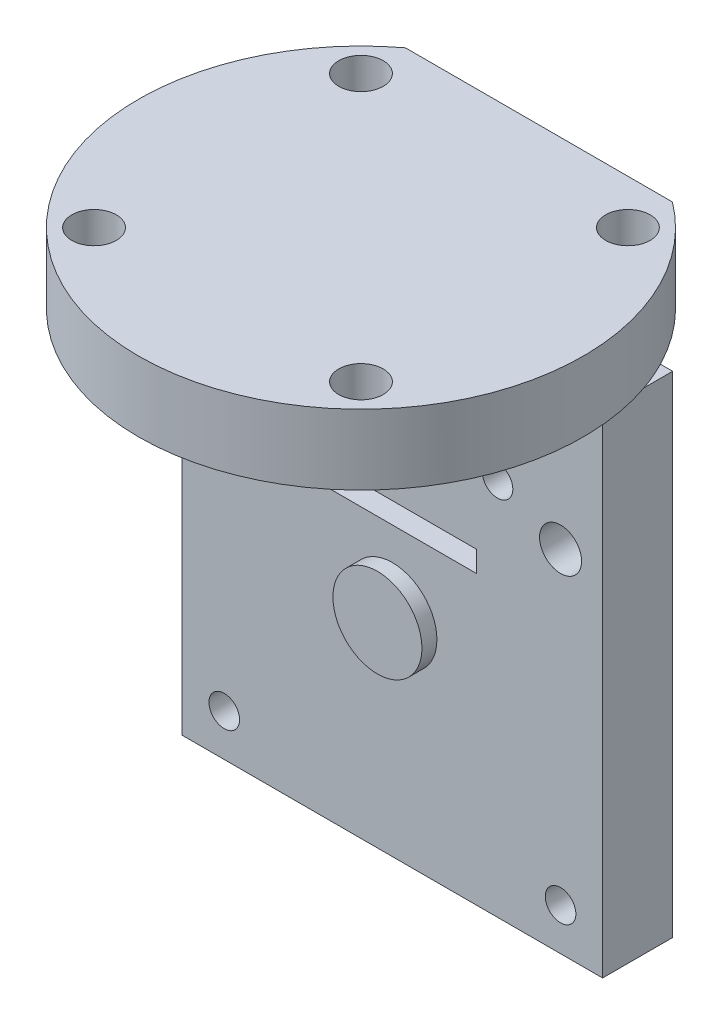
ISO-10303-21;
HEADER;
FILE_DESCRIPTION(('STEP AP214'),'2;1');
FILE_NAME('part.step','',(''),(''),'','','');
FILE_SCHEMA(('AUTOMOTIVE_DESIGN { 1 0 10303 214 1 1 1 1 }'));
ENDSEC;
DATA;
#1=APPLICATION_CONTEXT('core data for automotive mechanical design processes');
#2=APPLICATION_PROTOCOL_DEFINITION('international standard','automotive_design',2000,#1);
#3=PRODUCT_CONTEXT('',#1,'mechanical');
#4=PRODUCT('Part','Part','',(#3));
#5=PRODUCT_RELATED_PRODUCT_CATEGORY('part','',(#4));
#6=PRODUCT_DEFINITION_FORMATION('','',#4);
#7=PRODUCT_DEFINITION_CONTEXT('part definition',#1,'design');
#8=PRODUCT_DEFINITION('design','',#6,#7);
#9=PRODUCT_DEFINITION_SHAPE('','',#8);
#10=(LENGTH_UNIT() NAMED_UNIT(*) SI_UNIT(.MILLI.,.METRE.));
#11=(NAMED_UNIT(*) PLANE_ANGLE_UNIT() SI_UNIT($,.RADIAN.));
#12=(NAMED_UNIT(*) SI_UNIT($,.STERADIAN.) SOLID_ANGLE_UNIT());
#13=UNCERTAINTY_MEASURE_WITH_UNIT(LENGTH_MEASURE(1.E-05),#10,'distance_accuracy_value','');
#14=(GEOMETRIC_REPRESENTATION_CONTEXT(3) GLOBAL_UNCERTAINTY_ASSIGNED_CONTEXT((#13)) GLOBAL_UNIT_ASSIGNED_CONTEXT((#10,
#11,#12)) REPRESENTATION_CONTEXT('',''));
#15=CARTESIAN_POINT('',(0.,0.,0.));
#16=DIRECTION('',(0.,0.,1.));
#17=DIRECTION('',(1.,0.,0.));
#18=AXIS2_PLACEMENT_3D('',#15,#16,#17);
#19=CARTESIAN_POINT('',(0.,0.,0.));
#20=DIRECTION('',(0.,1.,0.));
#21=DIRECTION('',(0.,0.,1.));
#22=AXIS2_PLACEMENT_3D('',#19,#20,#21);
#23=PLANE('',#22);
#24=CARTESIAN_POINT('',(9.525,0.,9.525));
#25=DIRECTION('',(0.,1.,0.));
#26=DIRECTION('',(0.,0.,1.));
#27=AXIS2_PLACEMENT_3D('',#24,#25,#26);
#28=CIRCLE('',#27,1.5875);
#29=CARTESIAN_POINT('',(9.525,0.,11.1125));
#30=VERTEX_POINT('',#29);
#31=EDGE_CURVE('E153',#30,#30,#28,.T.);
#32=ORIENTED_EDGE('',*,*,#31,.T.);
#33=EDGE_LOOP('',(#32));
#34=FACE_BOUND('',#33,.T.);
#35=CARTESIAN_POINT('',(-9.525,0.,9.525));
#36=DIRECTION('',(0.,1.,0.));
#37=DIRECTION('',(0.,0.,1.));
#38=AXIS2_PLACEMENT_3D('',#35,#36,#37);
#39=CIRCLE('',#38,1.5875);
#40=CARTESIAN_POINT('',(-9.525,0.,11.1125));
#41=VERTEX_POINT('',#40);
#42=EDGE_CURVE('E169',#41,#41,#39,.T.);
#43=ORIENTED_EDGE('',*,*,#42,.T.);
#44=EDGE_LOOP('',(#43));
#45=FACE_BOUND('',#44,.T.);
#46=DIRECTION('',(0.,0.,1.));
#47=VECTOR('',#46,1.);
#48=CARTESIAN_POINT('',(15.,0.,-7.245));
#49=LINE('',#48,#47);
#50=CARTESIAN_POINT('',(15.,0.,-5.19765572157295));
#51=VERTEX_POINT('',#50);
#52=CARTESIAN_POINT('',(15.,0.,-2.245));
#53=VERTEX_POINT('',#52);
#54=EDGE_CURVE('E49',#51,#53,#49,.T.);
#55=ORIENTED_EDGE('',*,*,#54,.F.);
#56=CARTESIAN_POINT('',(0.,0.,0.));
#57=DIRECTION('',(0.,1.,0.));
#58=DIRECTION('',(0.,0.,1.));
#59=AXIS2_PLACEMENT_3D('',#56,#57,#58);
#60=CIRCLE('',#59,15.875);
#61=CARTESIAN_POINT('',(-15.,0.,-5.19765572157295));
#62=VERTEX_POINT('',#61);
#63=EDGE_CURVE('E106',#62,#51,#60,.T.);
#64=ORIENTED_EDGE('',*,*,#63,.F.);
#65=DIRECTION('',(0.,0.,1.));
#66=VECTOR('',#65,1.);
#67=CARTESIAN_POINT('',(-15.,0.,-7.245));
#68=LINE('',#67,#66);
#69=CARTESIAN_POINT('',(-15.,0.,-2.245));
#70=VERTEX_POINT('',#69);
#71=EDGE_CURVE('E131',#62,#70,#68,.T.);
#72=ORIENTED_EDGE('',*,*,#71,.T.);
#73=DIRECTION('',(-1.,0.,0.));
#74=VECTOR('',#73,1.);
#75=CARTESIAN_POINT('',(-15.,0.,-2.245));
#76=LINE('',#75,#74);
#77=EDGE_CURVE('E59',#53,#70,#76,.T.);
#78=ORIENTED_EDGE('',*,*,#77,.F.);
#79=EDGE_LOOP('',(#55,#64,#72,#78));
#80=FACE_BOUND('',#79,.T.);
#81=ADVANCED_FACE('F39',(#34,#45,#80),#23,.F.);
#82=CARTESIAN_POINT('',(0.,5.,0.));
#83=DIRECTION('',(0.,1.,0.));
#84=DIRECTION('',(0.,0.,1.));
#85=AXIS2_PLACEMENT_3D('',#82,#83,#84);
#86=PLANE('',#85);
#87=CARTESIAN_POINT('',(-9.525,5.,9.525));
#88=DIRECTION('',(0.,1.,0.));
#89=DIRECTION('',(0.,0.,1.));
#90=AXIS2_PLACEMENT_3D('',#87,#88,#89);
#91=CIRCLE('',#90,1.5875);
#92=CARTESIAN_POINT('',(-9.525,5.,11.1125));
#93=VERTEX_POINT('',#92);
#94=EDGE_CURVE('E173',#93,#93,#91,.T.);
#95=ORIENTED_EDGE('',*,*,#94,.F.);
#96=EDGE_LOOP('',(#95));
#97=FACE_BOUND('',#96,.T.);
#98=CARTESIAN_POINT('',(9.525,5.,-9.525));
#99=DIRECTION('',(0.,1.,0.));
#100=DIRECTION('',(0.,0.,1.));
#101=AXIS2_PLACEMENT_3D('',#98,#99,#100);
#102=CIRCLE('',#101,1.5875);
#103=CARTESIAN_POINT('',(9.525,5.,-7.9375));
#104=VERTEX_POINT('',#103);
#105=EDGE_CURVE('E110',#104,#104,#102,.T.);
#106=ORIENTED_EDGE('',*,*,#105,.F.);
#107=EDGE_LOOP('',(#106));
#108=FACE_BOUND('',#107,.T.);
#109=CARTESIAN_POINT('',(0.,5.,0.));
#110=DIRECTION('',(0.,1.,0.));
#111=DIRECTION('',(0.,0.,1.));
#112=AXIS2_PLACEMENT_3D('',#109,#110,#111);
#113=CIRCLE('',#112,15.875);
#114=CARTESIAN_POINT('',(-9.525,5.,-12.7));
#115=VERTEX_POINT('',#114);
#116=CARTESIAN_POINT('',(9.525,5.,-12.7));
#117=VERTEX_POINT('',#116);
#118=EDGE_CURVE('E90',#115,#117,#113,.T.);
#119=ORIENTED_EDGE('',*,*,#118,.T.);
#120=DIRECTION('',(-1.,0.,0.));
#121=VECTOR('',#120,1.);
#122=CARTESIAN_POINT('',(9.525,5.,-12.7));
#123=LINE('',#122,#121);
#124=EDGE_CURVE('E67',#117,#115,#123,.T.);
#125=ORIENTED_EDGE('',*,*,#124,.T.);
#126=EDGE_LOOP('',(#119,#125));
#127=FACE_BOUND('',#126,.T.);
#128=CARTESIAN_POINT('',(-9.525,5.,-9.525));
#129=DIRECTION('',(0.,1.,0.));
#130=DIRECTION('',(0.,0.,1.));
#131=AXIS2_PLACEMENT_3D('',#128,#129,#130);
#132=CIRCLE('',#131,1.5875);
#133=CARTESIAN_POINT('',(-9.525,5.,-7.9375));
#134=VERTEX_POINT('',#133);
#135=EDGE_CURVE('E121',#134,#134,#132,.T.);
#136=ORIENTED_EDGE('',*,*,#135,.F.);
#137=EDGE_LOOP('',(#136));
#138=FACE_BOUND('',#137,.T.);
#139=CARTESIAN_POINT('',(9.525,5.,9.525));
#140=DIRECTION('',(0.,1.,0.));
#141=DIRECTION('',(0.,0.,1.));
#142=AXIS2_PLACEMENT_3D('',#139,#140,#141);
#143=CIRCLE('',#142,1.5875);
#144=CARTESIAN_POINT('',(9.525,5.,11.1125));
#145=VERTEX_POINT('',#144);
#146=EDGE_CURVE('E165',#145,#145,#143,.T.);
#147=ORIENTED_EDGE('',*,*,#146,.F.);
#148=EDGE_LOOP('',(#147));
#149=FACE_BOUND('',#148,.T.);
#150=ADVANCED_FACE('F202',(#97,#108,#127,#138,#149),#86,.T.);
#151=CARTESIAN_POINT('',(14.1253530929319,0.,-7.245));
#152=VERTEX_POINT('',#151);
#153=CARTESIAN_POINT('',(9.525,0.,-12.7));
#154=VERTEX_POINT('',#153);
#155=EDGE_CURVE('E104',#152,#154,#60,.T.);
#156=ORIENTED_EDGE('',*,*,#155,.F.);
#157=DIRECTION('',(-1.,0.,0.));
#158=VECTOR('',#157,1.);
#159=CARTESIAN_POINT('',(-15.,0.,-7.245));
#160=LINE('',#159,#158);
#161=CARTESIAN_POINT('',(-14.1253530929319,0.,-7.245));
#162=VERTEX_POINT('',#161);
#163=EDGE_CURVE('E11',#152,#162,#160,.T.);
#164=ORIENTED_EDGE('',*,*,#163,.T.);
#165=CARTESIAN_POINT('',(-9.525,0.,-12.7));
#166=VERTEX_POINT('',#165);
#167=EDGE_CURVE('E91',#166,#162,#60,.T.);
#168=ORIENTED_EDGE('',*,*,#167,.F.);
#169=DIRECTION('',(-1.,0.,0.));
#170=VECTOR('',#169,1.);
#171=CARTESIAN_POINT('',(9.525,0.,-12.7));
#172=LINE('',#171,#170);
#173=EDGE_CURVE('E80',#154,#166,#172,.T.);
#174=ORIENTED_EDGE('',*,*,#173,.F.);
#175=EDGE_LOOP('',(#156,#164,#168,#174));
#176=FACE_BOUND('',#175,.T.);
#177=CARTESIAN_POINT('',(9.525,0.,-9.525));
#178=DIRECTION('',(0.,1.,0.));
#179=DIRECTION('',(0.,0.,1.));
#180=AXIS2_PLACEMENT_3D('',#177,#178,#179);
#181=CIRCLE('',#180,1.5875);
#182=CARTESIAN_POINT('',(9.525,0.,-7.9375));
#183=VERTEX_POINT('',#182);
#184=EDGE_CURVE('E115',#183,#183,#181,.T.);
#185=ORIENTED_EDGE('',*,*,#184,.T.);
#186=EDGE_LOOP('',(#185));
#187=FACE_BOUND('',#186,.T.);
#188=CARTESIAN_POINT('',(-9.525,0.,-9.525));
#189=DIRECTION('',(0.,1.,0.));
#190=DIRECTION('',(0.,0.,1.));
#191=AXIS2_PLACEMENT_3D('',#188,#189,#190);
#192=CIRCLE('',#191,1.5875);
#193=CARTESIAN_POINT('',(-9.525,0.,-7.9375));
#194=VERTEX_POINT('',#193);
#195=EDGE_CURVE('E124',#194,#194,#192,.T.);
#196=ORIENTED_EDGE('',*,*,#195,.T.);
#197=EDGE_LOOP('',(#196));
#198=FACE_BOUND('',#197,.T.);
#199=ADVANCED_FACE('F98',(#176,#187,#198),#23,.F.);
#200=CARTESIAN_POINT('',(0.,5.,0.));
#201=DIRECTION('',(0.,-1.,0.));
#202=DIRECTION('',(0.,0.,-1.));
#203=AXIS2_PLACEMENT_3D('',#200,#201,#202);
#204=CYLINDRICAL_SURFACE('',#203,15.875);
#205=ORIENTED_EDGE('',*,*,#167,.T.);
#206=EDGE_CURVE('E102',#162,#62,#60,.T.);
#207=ORIENTED_EDGE('',*,*,#206,.T.);
#208=ORIENTED_EDGE('',*,*,#63,.T.);
#209=EDGE_CURVE('E109',#51,#152,#60,.T.);
#210=ORIENTED_EDGE('',*,*,#209,.T.);
#211=ORIENTED_EDGE('',*,*,#155,.T.);
#212=DIRECTION('',(0.,-1.,0.));
#213=VECTOR('',#212,1.);
#214=CARTESIAN_POINT('',(9.525,5.,-12.7));
#215=LINE('',#214,#213);
#216=EDGE_CURVE('E43',#117,#154,#215,.T.);
#217=ORIENTED_EDGE('',*,*,#216,.F.);
#218=ORIENTED_EDGE('',*,*,#118,.F.);
#219=DIRECTION('',(0.,-1.,0.));
#220=VECTOR('',#219,1.);
#221=CARTESIAN_POINT('',(-9.525,5.,-12.7));
#222=LINE('',#221,#220);
#223=EDGE_CURVE('E83',#115,#166,#222,.T.);
#224=ORIENTED_EDGE('',*,*,#223,.T.);
#225=EDGE_LOOP('',(#205,#207,#208,#210,#211,#217,#218,#224));
#226=FACE_BOUND('',#225,.T.);
#227=ADVANCED_FACE('F41',(#226),#204,.T.);
#228=CARTESIAN_POINT('',(9.525,5.,-12.7));
#229=DIRECTION('',(0.,0.,1.));
#230=DIRECTION('',(1.,0.,0.));
#231=AXIS2_PLACEMENT_3D('',#228,#229,#230);
#232=PLANE('',#231);
#233=ORIENTED_EDGE('',*,*,#173,.T.);
#234=ORIENTED_EDGE('',*,*,#223,.F.);
#235=ORIENTED_EDGE('',*,*,#124,.F.);
#236=ORIENTED_EDGE('',*,*,#216,.T.);
#237=EDGE_LOOP('',(#233,#234,#235,#236));
#238=FACE_BOUND('',#237,.T.);
#239=ADVANCED_FACE('F82',(#238),#232,.F.);
#240=CARTESIAN_POINT('',(9.525,5.,-9.525));
#241=DIRECTION('',(0.,-1.,0.));
#242=DIRECTION('',(0.,0.,-1.));
#243=AXIS2_PLACEMENT_3D('',#240,#241,#242);
#244=CYLINDRICAL_SURFACE('',#243,1.5875);
#245=ORIENTED_EDGE('',*,*,#105,.T.);
#246=EDGE_LOOP('',(#245));
#247=FACE_BOUND('',#246,.T.);
#248=ORIENTED_EDGE('',*,*,#184,.F.);
#249=EDGE_LOOP('',(#248));
#250=FACE_BOUND('',#249,.T.);
#251=ADVANCED_FACE('F191',(#247,#250),#244,.F.);
#252=CARTESIAN_POINT('',(-9.525,5.,-9.525));
#253=DIRECTION('',(0.,-1.,0.));
#254=DIRECTION('',(0.,0.,-1.));
#255=AXIS2_PLACEMENT_3D('',#252,#253,#254);
#256=CYLINDRICAL_SURFACE('',#255,1.5875);
#257=ORIENTED_EDGE('',*,*,#135,.T.);
#258=EDGE_LOOP('',(#257));
#259=FACE_BOUND('',#258,.T.);
#260=ORIENTED_EDGE('',*,*,#195,.F.);
#261=EDGE_LOOP('',(#260));
#262=FACE_BOUND('',#261,.T.);
#263=ADVANCED_FACE('F188',(#259,#262),#256,.F.);
#264=CARTESIAN_POINT('',(-9.525,5.,9.525));
#265=DIRECTION('',(0.,-1.,0.));
#266=DIRECTION('',(0.,0.,-1.));
#267=AXIS2_PLACEMENT_3D('',#264,#265,#266);
#268=CYLINDRICAL_SURFACE('',#267,1.5875);
#269=ORIENTED_EDGE('',*,*,#94,.T.);
#270=EDGE_LOOP('',(#269));
#271=FACE_BOUND('',#270,.T.);
#272=ORIENTED_EDGE('',*,*,#42,.F.);
#273=EDGE_LOOP('',(#272));
#274=FACE_BOUND('',#273,.T.);
#275=ADVANCED_FACE('F190',(#271,#274),#268,.F.);
#276=CARTESIAN_POINT('',(9.525,5.,9.525));
#277=DIRECTION('',(0.,-1.,0.));
#278=DIRECTION('',(0.,0.,-1.));
#279=AXIS2_PLACEMENT_3D('',#276,#277,#278);
#280=CYLINDRICAL_SURFACE('',#279,1.5875);
#281=ORIENTED_EDGE('',*,*,#146,.T.);
#282=EDGE_LOOP('',(#281));
#283=FACE_BOUND('',#282,.T.);
#284=ORIENTED_EDGE('',*,*,#31,.F.);
#285=EDGE_LOOP('',(#284));
#286=FACE_BOUND('',#285,.T.);
#287=ADVANCED_FACE('F197',(#283,#286),#280,.F.);
#288=CARTESIAN_POINT('',(-15.,0.,-7.245));
#289=DIRECTION('',(0.,1.,0.));
#290=DIRECTION('',(0.,0.,1.));
#291=AXIS2_PLACEMENT_3D('',#288,#289,#290);
#292=PLANE('',#291);
#293=ORIENTED_EDGE('',*,*,#206,.F.);
#294=CARTESIAN_POINT('',(-15.,0.,-7.245));
#295=VERTEX_POINT('',#294);
#296=EDGE_CURVE('E52',#162,#295,#160,.T.);
#297=ORIENTED_EDGE('',*,*,#296,.T.);
#298=EDGE_CURVE('E135',#295,#62,#68,.T.);
#299=ORIENTED_EDGE('',*,*,#298,.T.);
#300=EDGE_LOOP('',(#293,#297,#299));
#301=FACE_BOUND('',#300,.T.);
#302=ADVANCED_FACE('F243',(#301),#292,.T.);
#303=ORIENTED_EDGE('',*,*,#209,.F.);
#304=CARTESIAN_POINT('',(15.,0.,-7.245));
#305=VERTEX_POINT('',#304);
#306=EDGE_CURVE('E138',#305,#51,#49,.T.);
#307=ORIENTED_EDGE('',*,*,#306,.F.);
#308=EDGE_CURVE('E51',#305,#152,#160,.T.);
#309=ORIENTED_EDGE('',*,*,#308,.T.);
#310=EDGE_LOOP('',(#303,#307,#309));
#311=FACE_BOUND('',#310,.T.);
#312=ADVANCED_FACE('F278',(#311),#292,.T.);
#313=CARTESIAN_POINT('',(-15.,0.,-7.245));
#314=DIRECTION('',(-1.,0.,0.));
#315=DIRECTION('',(0.,0.,1.));
#316=AXIS2_PLACEMENT_3D('',#313,#314,#315);
#317=PLANE('',#316);
#318=DIRECTION('',(0.,-1.,0.));
#319=VECTOR('',#318,1.);
#320=CARTESIAN_POINT('',(-15.,0.,-2.245));
#321=LINE('',#320,#319);
#322=CARTESIAN_POINT('',(-15.,-35.,-2.245));
#323=VERTEX_POINT('',#322);
#324=EDGE_CURVE('E583',#70,#323,#321,.T.);
#325=ORIENTED_EDGE('',*,*,#324,.F.);
#326=ORIENTED_EDGE('',*,*,#71,.F.);
#327=ORIENTED_EDGE('',*,*,#298,.F.);
#328=DIRECTION('',(0.,-1.,0.));
#329=VECTOR('',#328,1.);
#330=CARTESIAN_POINT('',(-15.,0.,-7.245));
#331=LINE('',#330,#329);
#332=CARTESIAN_POINT('',(-15.,-35.,-7.245));
#333=VERTEX_POINT('',#332);
#334=EDGE_CURVE('E587',#295,#333,#331,.T.);
#335=ORIENTED_EDGE('',*,*,#334,.T.);
#336=DIRECTION('',(0.,0.,1.));
#337=VECTOR('',#336,1.);
#338=CARTESIAN_POINT('',(-15.,-35.,-7.245));
#339=LINE('',#338,#337);
#340=EDGE_CURVE('E155',#333,#323,#339,.T.);
#341=ORIENTED_EDGE('',*,*,#340,.T.);
#342=EDGE_LOOP('',(#325,#326,#327,#335,#341));
#343=FACE_BOUND('',#342,.T.);
#344=ADVANCED_FACE('F288',(#343),#317,.T.);
#345=CARTESIAN_POINT('',(15.,0.,-7.245));
#346=DIRECTION('',(1.,0.,0.));
#347=DIRECTION('',(0.,0.,-1.));
#348=AXIS2_PLACEMENT_3D('',#345,#346,#347);
#349=PLANE('',#348);
#350=DIRECTION('',(0.,1.,0.));
#351=VECTOR('',#350,1.);
#352=CARTESIAN_POINT('',(15.,0.,-2.245));
#353=LINE('',#352,#351);
#354=CARTESIAN_POINT('',(15.,-35.,-2.245));
#355=VERTEX_POINT('',#354);
#356=EDGE_CURVE('E605',#355,#53,#353,.T.);
#357=ORIENTED_EDGE('',*,*,#356,.F.);
#358=DIRECTION('',(0.,0.,1.));
#359=VECTOR('',#358,1.);
#360=CARTESIAN_POINT('',(15.,-35.,-7.245));
#361=LINE('',#360,#359);
#362=CARTESIAN_POINT('',(15.,-35.,-7.245));
#363=VERTEX_POINT('',#362);
#364=EDGE_CURVE('E146',#363,#355,#361,.T.);
#365=ORIENTED_EDGE('',*,*,#364,.F.);
#366=DIRECTION('',(0.,1.,0.));
#367=VECTOR('',#366,1.);
#368=CARTESIAN_POINT('',(15.,0.,-7.245));
#369=LINE('',#368,#367);
#370=EDGE_CURVE('E594',#363,#305,#369,.T.);
#371=ORIENTED_EDGE('',*,*,#370,.T.);
#372=ORIENTED_EDGE('',*,*,#306,.T.);
#373=ORIENTED_EDGE('',*,*,#54,.T.);
#374=EDGE_LOOP('',(#357,#365,#371,#372,#373));
#375=FACE_BOUND('',#374,.T.);
#376=ADVANCED_FACE('F297',(#375),#349,.T.);
#377=CARTESIAN_POINT('',(-15.,-35.,-7.245));
#378=DIRECTION('',(0.,-1.,0.));
#379=DIRECTION('',(0.,0.,-1.));
#380=AXIS2_PLACEMENT_3D('',#377,#378,#379);
#381=PLANE('',#380);
#382=DIRECTION('',(1.,0.,0.));
#383=VECTOR('',#382,1.);
#384=CARTESIAN_POINT('',(-15.,-35.,-2.245));
#385=LINE('',#384,#383);
#386=EDGE_CURVE('E601',#323,#355,#385,.T.);
#387=ORIENTED_EDGE('',*,*,#386,.F.);
#388=ORIENTED_EDGE('',*,*,#340,.F.);
#389=DIRECTION('',(1.,0.,0.));
#390=VECTOR('',#389,1.);
#391=CARTESIAN_POINT('',(-15.,-35.,-7.245));
#392=LINE('',#391,#390);
#393=EDGE_CURVE('E591',#333,#363,#392,.T.);
#394=ORIENTED_EDGE('',*,*,#393,.T.);
#395=ORIENTED_EDGE('',*,*,#364,.T.);
#396=EDGE_LOOP('',(#387,#388,#394,#395));
#397=FACE_BOUND('',#396,.T.);
#398=ADVANCED_FACE('F307',(#397),#381,.T.);
#399=CARTESIAN_POINT('',(0.,0.,-7.245));
#400=DIRECTION('',(0.,0.,1.));
#401=DIRECTION('',(1.,0.,0.));
#402=AXIS2_PLACEMENT_3D('',#399,#400,#401);
#403=PLANE('',#402);
#404=CARTESIAN_POINT('',(12.,-10.,-7.245));
#405=DIRECTION('',(0.,0.,-1.));
#406=DIRECTION('',(-1.,0.,0.));
#407=AXIS2_PLACEMENT_3D('',#404,#405,#406);
#408=CIRCLE('',#407,1.5);
#409=CARTESIAN_POINT('',(10.5,-10.,-7.245));
#410=VERTEX_POINT('',#409);
#411=EDGE_CURVE('E473',#410,#410,#408,.T.);
#412=ORIENTED_EDGE('',*,*,#411,.F.);
#413=EDGE_LOOP('',(#412));
#414=FACE_BOUND('',#413,.T.);
#415=CARTESIAN_POINT('',(0.,-10.,-7.245));
#416=DIRECTION('',(0.,0.,-1.));
#417=DIRECTION('',(-1.,0.,0.));
#418=AXIS2_PLACEMENT_3D('',#415,#416,#417);
#419=CIRCLE('',#418,1.5);
#420=CARTESIAN_POINT('',(-1.5,-10.,-7.245));
#421=VERTEX_POINT('',#420);
#422=EDGE_CURVE('E488',#421,#421,#419,.T.);
#423=ORIENTED_EDGE('',*,*,#422,.F.);
#424=EDGE_LOOP('',(#423));
#425=FACE_BOUND('',#424,.T.);
#426=CARTESIAN_POINT('',(-12.,-10.,-7.245));
#427=DIRECTION('',(0.,0.,-1.));
#428=DIRECTION('',(-1.,0.,0.));
#429=AXIS2_PLACEMENT_3D('',#426,#427,#428);
#430=CIRCLE('',#429,1.5);
#431=CARTESIAN_POINT('',(-13.5,-10.,-7.245));
#432=VERTEX_POINT('',#431);
#433=EDGE_CURVE('E496',#432,#432,#430,.T.);
#434=ORIENTED_EDGE('',*,*,#433,.F.);
#435=EDGE_LOOP('',(#434));
#436=FACE_BOUND('',#435,.T.);
#437=CARTESIAN_POINT('',(12.,-32.,-7.245));
#438=DIRECTION('',(0.,0.,1.));
#439=DIRECTION('',(1.,0.,0.));
#440=AXIS2_PLACEMENT_3D('',#437,#438,#439);
#441=CIRCLE('',#440,1.0922);
#442=CARTESIAN_POINT('',(13.0922,-32.,-7.245));
#443=VERTEX_POINT('',#442);
#444=EDGE_CURVE('E503',#443,#443,#441,.T.);
#445=ORIENTED_EDGE('',*,*,#444,.T.);
#446=EDGE_LOOP('',(#445));
#447=FACE_BOUND('',#446,.T.);
#448=DIRECTION('',(-1.,0.,0.));
#449=VECTOR('',#448,1.);
#450=CARTESIAN_POINT('',(-6.,-13.,-7.245));
#451=LINE('',#450,#449);
#452=CARTESIAN_POINT('',(6.,-13.,-7.245));
#453=VERTEX_POINT('',#452);
#454=CARTESIAN_POINT('',(-6.,-13.,-7.245));
#455=VERTEX_POINT('',#454);
#456=EDGE_CURVE('E528',#453,#455,#451,.T.);
#457=ORIENTED_EDGE('',*,*,#456,.T.);
#458=DIRECTION('',(0.,-1.,0.));
#459=VECTOR('',#458,1.);
#460=CARTESIAN_POINT('',(-6.,-13.,-7.245));
#461=LINE('',#460,#459);
#462=CARTESIAN_POINT('',(-6.,-14.5,-7.245));
#463=VERTEX_POINT('',#462);
#464=EDGE_CURVE('E515',#455,#463,#461,.T.);
#465=ORIENTED_EDGE('',*,*,#464,.T.);
#466=DIRECTION('',(1.,0.,0.));
#467=VECTOR('',#466,1.);
#468=CARTESIAN_POINT('',(-6.,-14.5,-7.245));
#469=LINE('',#468,#467);
#470=CARTESIAN_POINT('',(6.,-14.5,-7.245));
#471=VERTEX_POINT('',#470);
#472=EDGE_CURVE('E519',#463,#471,#469,.T.);
#473=ORIENTED_EDGE('',*,*,#472,.T.);
#474=DIRECTION('',(0.,1.,0.));
#475=VECTOR('',#474,1.);
#476=CARTESIAN_POINT('',(6.,-13.,-7.245));
#477=LINE('',#476,#475);
#478=EDGE_CURVE('E524',#471,#453,#477,.T.);
#479=ORIENTED_EDGE('',*,*,#478,.T.);
#480=EDGE_LOOP('',(#457,#465,#473,#479));
#481=FACE_BOUND('',#480,.T.);
#482=CARTESIAN_POINT('',(7.5,-8.,-7.245));
#483=DIRECTION('',(0.,0.,1.));
#484=DIRECTION('',(1.,0.,0.));
#485=AXIS2_PLACEMENT_3D('',#482,#483,#484);
#486=CIRCLE('',#485,1.0922);
#487=CARTESIAN_POINT('',(8.5922,-8.,-7.245));
#488=VERTEX_POINT('',#487);
#489=EDGE_CURVE('E563',#488,#488,#486,.T.);
#490=ORIENTED_EDGE('',*,*,#489,.T.);
#491=EDGE_LOOP('',(#490));
#492=FACE_BOUND('',#491,.T.);
#493=CARTESIAN_POINT('',(-7.5,-8.,-7.245));
#494=DIRECTION('',(0.,0.,1.));
#495=DIRECTION('',(1.,0.,0.));
#496=AXIS2_PLACEMENT_3D('',#493,#494,#495);
#497=CIRCLE('',#496,1.0922);
#498=CARTESIAN_POINT('',(-6.4078,-8.,-7.245));
#499=VERTEX_POINT('',#498);
#500=EDGE_CURVE('E571',#499,#499,#497,.T.);
#501=ORIENTED_EDGE('',*,*,#500,.T.);
#502=EDGE_LOOP('',(#501));
#503=FACE_BOUND('',#502,.T.);
#504=CARTESIAN_POINT('',(-12.,-32.,-7.245));
#505=DIRECTION('',(0.,0.,1.));
#506=DIRECTION('',(1.,0.,0.));
#507=AXIS2_PLACEMENT_3D('',#504,#505,#506);
#508=CIRCLE('',#507,1.0922);
#509=CARTESIAN_POINT('',(-10.9078,-32.,-7.245));
#510=VERTEX_POINT('',#509);
#511=EDGE_CURVE('E579',#510,#510,#508,.T.);
#512=ORIENTED_EDGE('',*,*,#511,.T.);
#513=EDGE_LOOP('',(#512));
#514=FACE_BOUND('',#513,.T.);
#515=ORIENTED_EDGE('',*,*,#334,.F.);
#516=ORIENTED_EDGE('',*,*,#296,.F.);
#517=ORIENTED_EDGE('',*,*,#163,.F.);
#518=ORIENTED_EDGE('',*,*,#308,.F.);
#519=ORIENTED_EDGE('',*,*,#370,.F.);
#520=ORIENTED_EDGE('',*,*,#393,.F.);
#521=EDGE_LOOP('',(#515,#516,#517,#518,#519,#520));
#522=FACE_BOUND('',#521,.T.);
#523=ADVANCED_FACE('F316',(#414,#425,#436,#447,#481,#492,#503,#514,#522),#403,.F.);
#524=CARTESIAN_POINT('',(0.,0.,-2.245));
#525=DIRECTION('',(0.,0.,1.));
#526=DIRECTION('',(1.,0.,0.));
#527=AXIS2_PLACEMENT_3D('',#524,#525,#526);
#528=PLANE('',#527);
#529=CARTESIAN_POINT('',(12.,-10.,-2.245));
#530=DIRECTION('',(0.,0.,1.));
#531=DIRECTION('',(1.,0.,0.));
#532=AXIS2_PLACEMENT_3D('',#529,#530,#531);
#533=CIRCLE('',#532,1.5);
#534=CARTESIAN_POINT('',(13.5,-10.,-2.245));
#535=VERTEX_POINT('',#534);
#536=EDGE_CURVE('E476',#535,#535,#533,.F.);
#537=ORIENTED_EDGE('',*,*,#536,.T.);
#538=EDGE_LOOP('',(#537));
#539=FACE_BOUND('',#538,.T.);
#540=CARTESIAN_POINT('',(0.,-10.,-2.245));
#541=DIRECTION('',(0.,0.,1.));
#542=DIRECTION('',(1.,0.,0.));
#543=AXIS2_PLACEMENT_3D('',#540,#541,#542);
#544=CIRCLE('',#543,1.5);
#545=CARTESIAN_POINT('',(1.5,-10.,-2.245));
#546=VERTEX_POINT('',#545);
#547=EDGE_CURVE('E485',#546,#546,#544,.F.);
#548=ORIENTED_EDGE('',*,*,#547,.T.);
#549=EDGE_LOOP('',(#548));
#550=FACE_BOUND('',#549,.T.);
#551=CARTESIAN_POINT('',(-12.,-10.,-2.245));
#552=DIRECTION('',(0.,0.,1.));
#553=DIRECTION('',(1.,0.,0.));
#554=AXIS2_PLACEMENT_3D('',#551,#552,#553);
#555=CIRCLE('',#554,1.5);
#556=CARTESIAN_POINT('',(-10.5,-10.,-2.245));
#557=VERTEX_POINT('',#556);
#558=EDGE_CURVE('E492',#557,#557,#555,.F.);
#559=ORIENTED_EDGE('',*,*,#558,.T.);
#560=EDGE_LOOP('',(#559));
#561=FACE_BOUND('',#560,.T.);
#562=CARTESIAN_POINT('',(12.,-32.,-2.245));
#563=DIRECTION('',(0.,0.,1.));
#564=DIRECTION('',(1.,0.,0.));
#565=AXIS2_PLACEMENT_3D('',#562,#563,#564);
#566=CIRCLE('',#565,1.0922);
#567=CARTESIAN_POINT('',(13.0922,-32.,-2.245));
#568=VERTEX_POINT('',#567);
#569=EDGE_CURVE('E483',#568,#568,#566,.T.);
#570=ORIENTED_EDGE('',*,*,#569,.F.);
#571=EDGE_LOOP('',(#570));
#572=FACE_BOUND('',#571,.T.);
#573=CARTESIAN_POINT('',(0.,-20.,-2.245));
#574=DIRECTION('',(0.,0.,1.));
#575=DIRECTION('',(1.,0.,0.));
#576=AXIS2_PLACEMENT_3D('',#573,#574,#575);
#577=CIRCLE('',#576,3.175);
#578=CARTESIAN_POINT('',(3.175,-20.,-2.245));
#579=VERTEX_POINT('',#578);
#580=EDGE_CURVE('E507',#579,#579,#577,.T.);
#581=ORIENTED_EDGE('',*,*,#580,.F.);
#582=EDGE_LOOP('',(#581));
#583=FACE_BOUND('',#582,.T.);
#584=DIRECTION('',(0.,-1.,0.));
#585=VECTOR('',#584,1.);
#586=CARTESIAN_POINT('',(-6.,-13.,-2.245));
#587=LINE('',#586,#585);
#588=CARTESIAN_POINT('',(-6.,-13.,-2.245));
#589=VERTEX_POINT('',#588);
#590=CARTESIAN_POINT('',(-6.,-14.5,-2.245));
#591=VERTEX_POINT('',#590);
#592=EDGE_CURVE('E514',#589,#591,#587,.T.);
#593=ORIENTED_EDGE('',*,*,#592,.F.);
#594=DIRECTION('',(-1.,0.,0.));
#595=VECTOR('',#594,1.);
#596=CARTESIAN_POINT('',(-6.,-13.,-2.245));
#597=LINE('',#596,#595);
#598=CARTESIAN_POINT('',(6.,-13.,-2.245));
#599=VERTEX_POINT('',#598);
#600=EDGE_CURVE('E520',#599,#589,#597,.T.);
#601=ORIENTED_EDGE('',*,*,#600,.F.);
#602=DIRECTION('',(0.,1.,0.));
#603=VECTOR('',#602,1.);
#604=CARTESIAN_POINT('',(6.,-13.,-2.245));
#605=LINE('',#604,#603);
#606=CARTESIAN_POINT('',(6.,-14.5,-2.245));
#607=VERTEX_POINT('',#606);
#608=EDGE_CURVE('E540',#607,#599,#605,.T.);
#609=ORIENTED_EDGE('',*,*,#608,.F.);
#610=DIRECTION('',(1.,0.,0.));
#611=VECTOR('',#610,1.);
#612=CARTESIAN_POINT('',(-6.,-14.5,-2.245));
#613=LINE('',#612,#611);
#614=EDGE_CURVE('E536',#591,#607,#613,.T.);
#615=ORIENTED_EDGE('',*,*,#614,.F.);
#616=EDGE_LOOP('',(#593,#601,#609,#615));
#617=FACE_BOUND('',#616,.T.);
#618=CARTESIAN_POINT('',(7.5,-8.,-2.245));
#619=DIRECTION('',(0.,0.,1.));
#620=DIRECTION('',(1.,0.,0.));
#621=AXIS2_PLACEMENT_3D('',#618,#619,#620);
#622=CIRCLE('',#621,1.0922);
#623=CARTESIAN_POINT('',(8.5922,-8.,-2.245));
#624=VERTEX_POINT('',#623);
#625=EDGE_CURVE('E551',#624,#624,#622,.T.);
#626=ORIENTED_EDGE('',*,*,#625,.F.);
#627=EDGE_LOOP('',(#626));
#628=FACE_BOUND('',#627,.T.);
#629=CARTESIAN_POINT('',(-7.5,-8.,-2.245));
#630=DIRECTION('',(0.,0.,1.));
#631=DIRECTION('',(1.,0.,0.));
#632=AXIS2_PLACEMENT_3D('',#629,#630,#631);
#633=CIRCLE('',#632,1.0922);
#634=CARTESIAN_POINT('',(-6.4078,-8.,-2.245));
#635=VERTEX_POINT('',#634);
#636=EDGE_CURVE('E567',#635,#635,#633,.T.);
#637=ORIENTED_EDGE('',*,*,#636,.F.);
#638=EDGE_LOOP('',(#637));
#639=FACE_BOUND('',#638,.T.);
#640=CARTESIAN_POINT('',(-12.,-32.,-2.245));
#641=DIRECTION('',(0.,0.,1.));
#642=DIRECTION('',(1.,0.,0.));
#643=AXIS2_PLACEMENT_3D('',#640,#641,#642);
#644=CIRCLE('',#643,1.0922);
#645=CARTESIAN_POINT('',(-10.9078,-32.,-2.245));
#646=VERTEX_POINT('',#645);
#647=EDGE_CURVE('E575',#646,#646,#644,.T.);
#648=ORIENTED_EDGE('',*,*,#647,.F.);
#649=EDGE_LOOP('',(#648));
#650=FACE_BOUND('',#649,.T.);
#651=ORIENTED_EDGE('',*,*,#324,.T.);
#652=ORIENTED_EDGE('',*,*,#386,.T.);
#653=ORIENTED_EDGE('',*,*,#356,.T.);
#654=ORIENTED_EDGE('',*,*,#77,.T.);
#655=EDGE_LOOP('',(#651,#652,#653,#654));
#656=FACE_BOUND('',#655,.T.);
#657=ADVANCED_FACE('F329',(#539,#550,#561,#572,#583,#617,#628,#639,#650,#656),#528,.T.);
#658=CARTESIAN_POINT('',(-12.,-32.,-7.245));
#659=DIRECTION('',(0.,0.,1.));
#660=DIRECTION('',(1.,0.,0.));
#661=AXIS2_PLACEMENT_3D('',#658,#659,#660);
#662=CYLINDRICAL_SURFACE('',#661,1.0922);
#663=ORIENTED_EDGE('',*,*,#511,.F.);
#664=EDGE_LOOP('',(#663));
#665=FACE_BOUND('',#664,.T.);
#666=ORIENTED_EDGE('',*,*,#647,.T.);
#667=EDGE_LOOP('',(#666));
#668=FACE_BOUND('',#667,.T.);
#669=ADVANCED_FACE('F323',(#665,#668),#662,.F.);
#670=CARTESIAN_POINT('',(-7.5,-8.,-7.245));
#671=DIRECTION('',(0.,0.,1.));
#672=DIRECTION('',(1.,0.,0.));
#673=AXIS2_PLACEMENT_3D('',#670,#671,#672);
#674=CYLINDRICAL_SURFACE('',#673,1.0922);
#675=ORIENTED_EDGE('',*,*,#500,.F.);
#676=EDGE_LOOP('',(#675));
#677=FACE_BOUND('',#676,.T.);
#678=ORIENTED_EDGE('',*,*,#636,.T.);
#679=EDGE_LOOP('',(#678));
#680=FACE_BOUND('',#679,.T.);
#681=ADVANCED_FACE('F328',(#677,#680),#674,.F.);
#682=CARTESIAN_POINT('',(7.5,-8.,-7.245));
#683=DIRECTION('',(0.,0.,1.));
#684=DIRECTION('',(1.,0.,0.));
#685=AXIS2_PLACEMENT_3D('',#682,#683,#684);
#686=CYLINDRICAL_SURFACE('',#685,1.0922);
#687=ORIENTED_EDGE('',*,*,#489,.F.);
#688=EDGE_LOOP('',(#687));
#689=FACE_BOUND('',#688,.T.);
#690=ORIENTED_EDGE('',*,*,#625,.T.);
#691=EDGE_LOOP('',(#690));
#692=FACE_BOUND('',#691,.T.);
#693=ADVANCED_FACE('F341',(#689,#692),#686,.F.);
#694=CARTESIAN_POINT('',(-6.,-13.,-7.245));
#695=DIRECTION('',(-1.,0.,0.));
#696=DIRECTION('',(0.,0.,1.));
#697=AXIS2_PLACEMENT_3D('',#694,#695,#696);
#698=PLANE('',#697);
#699=ORIENTED_EDGE('',*,*,#592,.T.);
#700=DIRECTION('',(0.,0.,1.));
#701=VECTOR('',#700,1.);
#702=CARTESIAN_POINT('',(-6.,-14.5,-7.245));
#703=LINE('',#702,#701);
#704=EDGE_CURVE('E532',#463,#591,#703,.T.);
#705=ORIENTED_EDGE('',*,*,#704,.F.);
#706=ORIENTED_EDGE('',*,*,#464,.F.);
#707=DIRECTION('',(0.,0.,1.));
#708=VECTOR('',#707,1.);
#709=CARTESIAN_POINT('',(-6.,-13.,-7.245));
#710=LINE('',#709,#708);
#711=EDGE_CURVE('E547',#455,#589,#710,.T.);
#712=ORIENTED_EDGE('',*,*,#711,.T.);
#713=EDGE_LOOP('',(#699,#705,#706,#712));
#714=FACE_BOUND('',#713,.T.);
#715=ADVANCED_FACE('F351',(#714),#698,.F.);
#716=CARTESIAN_POINT('',(-6.,-13.,-7.245));
#717=DIRECTION('',(0.,1.,0.));
#718=DIRECTION('',(0.,0.,1.));
#719=AXIS2_PLACEMENT_3D('',#716,#717,#718);
#720=PLANE('',#719);
#721=ORIENTED_EDGE('',*,*,#600,.T.);
#722=ORIENTED_EDGE('',*,*,#711,.F.);
#723=ORIENTED_EDGE('',*,*,#456,.F.);
#724=DIRECTION('',(0.,0.,1.));
#725=VECTOR('',#724,1.);
#726=CARTESIAN_POINT('',(6.,-13.,-7.245));
#727=LINE('',#726,#725);
#728=EDGE_CURVE('E552',#453,#599,#727,.T.);
#729=ORIENTED_EDGE('',*,*,#728,.T.);
#730=EDGE_LOOP('',(#721,#722,#723,#729));
#731=FACE_BOUND('',#730,.T.);
#732=ADVANCED_FACE('F361',(#731),#720,.F.);
#733=CARTESIAN_POINT('',(6.,-13.,-7.245));
#734=DIRECTION('',(1.,0.,0.));
#735=DIRECTION('',(0.,0.,-1.));
#736=AXIS2_PLACEMENT_3D('',#733,#734,#735);
#737=PLANE('',#736);
#738=ORIENTED_EDGE('',*,*,#608,.T.);
#739=ORIENTED_EDGE('',*,*,#728,.F.);
#740=ORIENTED_EDGE('',*,*,#478,.F.);
#741=DIRECTION('',(0.,0.,1.));
#742=VECTOR('',#741,1.);
#743=CARTESIAN_POINT('',(6.,-14.5,-7.245));
#744=LINE('',#743,#742);
#745=EDGE_CURVE('E556',#471,#607,#744,.T.);
#746=ORIENTED_EDGE('',*,*,#745,.T.);
#747=EDGE_LOOP('',(#738,#739,#740,#746));
#748=FACE_BOUND('',#747,.T.);
#749=ADVANCED_FACE('F371',(#748),#737,.F.);
#750=CARTESIAN_POINT('',(-6.,-14.5,-7.245));
#751=DIRECTION('',(0.,-1.,0.));
#752=DIRECTION('',(0.,0.,-1.));
#753=AXIS2_PLACEMENT_3D('',#750,#751,#752);
#754=PLANE('',#753);
#755=ORIENTED_EDGE('',*,*,#614,.T.);
#756=ORIENTED_EDGE('',*,*,#745,.F.);
#757=ORIENTED_EDGE('',*,*,#472,.F.);
#758=ORIENTED_EDGE('',*,*,#704,.T.);
#759=EDGE_LOOP('',(#755,#756,#757,#758));
#760=FACE_BOUND('',#759,.T.);
#761=ADVANCED_FACE('F381',(#760),#754,.F.);
#762=CARTESIAN_POINT('',(12.,-32.,-7.245));
#763=DIRECTION('',(0.,0.,1.));
#764=DIRECTION('',(1.,0.,0.));
#765=AXIS2_PLACEMENT_3D('',#762,#763,#764);
#766=CYLINDRICAL_SURFACE('',#765,1.0922);
#767=ORIENTED_EDGE('',*,*,#444,.F.);
#768=EDGE_LOOP('',(#767));
#769=FACE_BOUND('',#768,.T.);
#770=ORIENTED_EDGE('',*,*,#569,.T.);
#771=EDGE_LOOP('',(#770));
#772=FACE_BOUND('',#771,.T.);
#773=ADVANCED_FACE('F391',(#769,#772),#766,.F.);
#774=CARTESIAN_POINT('',(0.,-20.,-1.175));
#775=DIRECTION('',(0.,0.,-1.));
#776=DIRECTION('',(-1.,0.,0.));
#777=AXIS2_PLACEMENT_3D('',#774,#775,#776);
#778=CYLINDRICAL_SURFACE('',#777,3.175);
#779=ORIENTED_EDGE('',*,*,#580,.T.);
#780=EDGE_LOOP('',(#779));
#781=FACE_BOUND('',#780,.T.);
#782=CARTESIAN_POINT('',(0.,-20.,-1.175));
#783=DIRECTION('',(0.,0.,-1.));
#784=DIRECTION('',(-1.,0.,0.));
#785=AXIS2_PLACEMENT_3D('',#782,#783,#784);
#786=CIRCLE('',#785,3.175);
#787=CARTESIAN_POINT('',(-3.175,-20.,-1.175));
#788=VERTEX_POINT('',#787);
#789=EDGE_CURVE('E478',#788,#788,#786,.T.);
#790=ORIENTED_EDGE('',*,*,#789,.T.);
#791=EDGE_LOOP('',(#790));
#792=FACE_BOUND('',#791,.T.);
#793=ADVANCED_FACE('F401',(#781,#792),#778,.T.);
#794=CARTESIAN_POINT('',(0.,-20.,-1.175));
#795=DIRECTION('',(0.,0.,-1.));
#796=DIRECTION('',(-1.,0.,0.));
#797=AXIS2_PLACEMENT_3D('',#794,#795,#796);
#798=PLANE('',#797);
#799=ORIENTED_EDGE('',*,*,#789,.F.);
#800=EDGE_LOOP('',(#799));
#801=FACE_BOUND('',#800,.T.);
#802=ADVANCED_FACE('F412',(#801),#798,.F.);
#803=CARTESIAN_POINT('',(-12.,-10.,1.99764068711929));
#804=DIRECTION('',(0.,0.,-1.));
#805=DIRECTION('',(-1.,0.,0.));
#806=AXIS2_PLACEMENT_3D('',#803,#804,#805);
#807=CYLINDRICAL_SURFACE('',#806,1.5);
#808=ORIENTED_EDGE('',*,*,#433,.T.);
#809=EDGE_LOOP('',(#808));
#810=FACE_BOUND('',#809,.T.);
#811=ORIENTED_EDGE('',*,*,#558,.F.);
#812=EDGE_LOOP('',(#811));
#813=FACE_BOUND('',#812,.T.);
#814=ADVANCED_FACE('F422',(#810,#813),#807,.F.);
#815=CARTESIAN_POINT('',(0.,-10.,1.99764068711929));
#816=DIRECTION('',(0.,0.,-1.));
#817=DIRECTION('',(-1.,0.,0.));
#818=AXIS2_PLACEMENT_3D('',#815,#816,#817);
#819=CYLINDRICAL_SURFACE('',#818,1.5);
#820=ORIENTED_EDGE('',*,*,#422,.T.);
#821=EDGE_LOOP('',(#820));
#822=FACE_BOUND('',#821,.T.);
#823=ORIENTED_EDGE('',*,*,#547,.F.);
#824=EDGE_LOOP('',(#823));
#825=FACE_BOUND('',#824,.T.);
#826=ADVANCED_FACE('F446',(#822,#825),#819,.F.);
#827=CARTESIAN_POINT('',(12.,-10.,1.99764068711929));
#828=DIRECTION('',(0.,0.,-1.));
#829=DIRECTION('',(-1.,0.,0.));
#830=AXIS2_PLACEMENT_3D('',#827,#828,#829);
#831=CYLINDRICAL_SURFACE('',#830,1.5);
#832=ORIENTED_EDGE('',*,*,#411,.T.);
#833=EDGE_LOOP('',(#832));
#834=FACE_BOUND('',#833,.T.);
#835=ORIENTED_EDGE('',*,*,#536,.F.);
#836=EDGE_LOOP('',(#835));
#837=FACE_BOUND('',#836,.T.);
#838=ADVANCED_FACE('F456',(#834,#837),#831,.F.);
#839=CLOSED_SHELL('',(#81,#150,#199,#227,#239,#251,#263,#275,#287,#302,#312,#344,#376,#398,#523,
#657,#669,#681,#693,#715,#732,#749,#761,#773,#793,#802,#814,#826,#838));
#840=MANIFOLD_SOLID_BREP('B2',#839);
#841=ADVANCED_BREP_SHAPE_REPRESENTATION('',(#18,#840),#14);
#842=SHAPE_DEFINITION_REPRESENTATION(#9,#841);
ENDSEC;
END-ISO-10303-21;
